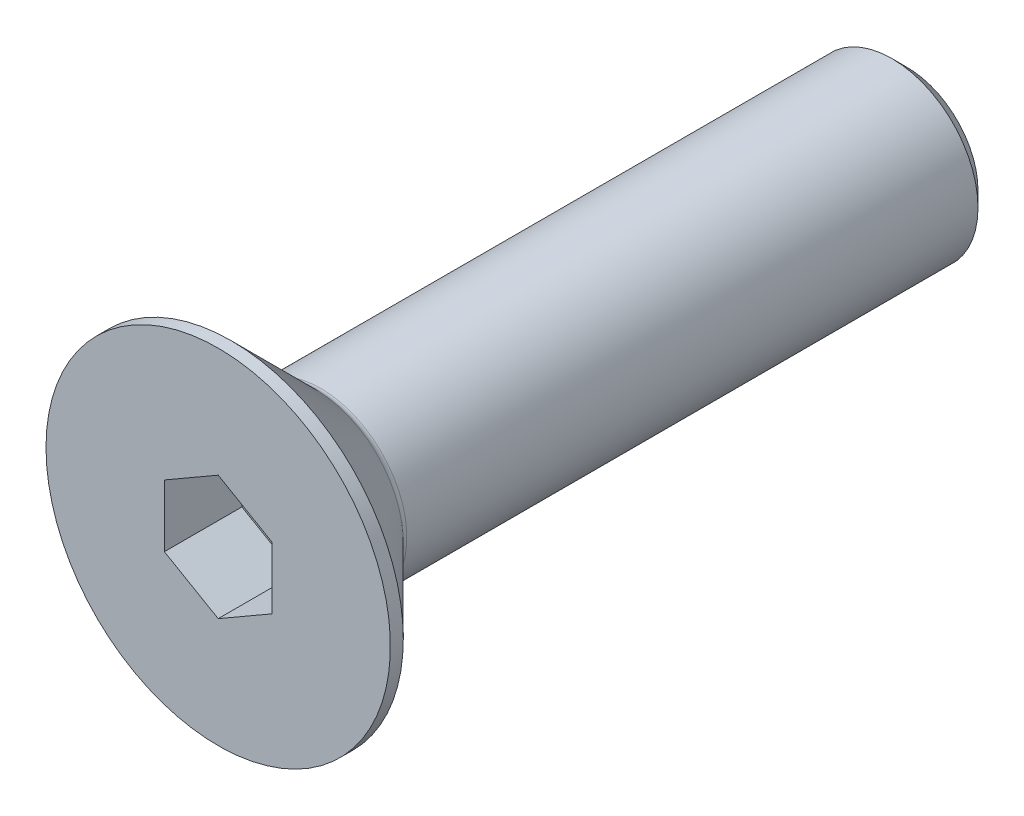
ISO-10303-21;
HEADER;
FILE_DESCRIPTION(('STEP AP214'),'2;1');
FILE_NAME('part.step','',(''),(''),'','','');
FILE_SCHEMA(('AUTOMOTIVE_DESIGN { 1 0 10303 214 1 1 1 1 }'));
ENDSEC;
DATA;
#1=APPLICATION_CONTEXT('core data for automotive mechanical design processes');
#2=APPLICATION_PROTOCOL_DEFINITION('international standard','automotive_design',2000,#1);
#3=PRODUCT_CONTEXT('',#1,'mechanical');
#4=PRODUCT('Part','Part','',(#3));
#5=PRODUCT_RELATED_PRODUCT_CATEGORY('part','',(#4));
#6=PRODUCT_DEFINITION_FORMATION('','',#4);
#7=PRODUCT_DEFINITION_CONTEXT('part definition',#1,'design');
#8=PRODUCT_DEFINITION('design','',#6,#7);
#9=PRODUCT_DEFINITION_SHAPE('','',#8);
#10=(LENGTH_UNIT() NAMED_UNIT(*) SI_UNIT(.MILLI.,.METRE.));
#11=(NAMED_UNIT(*) PLANE_ANGLE_UNIT() SI_UNIT($,.RADIAN.));
#12=(NAMED_UNIT(*) SI_UNIT($,.STERADIAN.) SOLID_ANGLE_UNIT());
#13=UNCERTAINTY_MEASURE_WITH_UNIT(LENGTH_MEASURE(1.E-05),#10,'distance_accuracy_value','');
#14=(GEOMETRIC_REPRESENTATION_CONTEXT(3) GLOBAL_UNCERTAINTY_ASSIGNED_CONTEXT((#13)) GLOBAL_UNIT_ASSIGNED_CONTEXT((#10,
#11,#12)) REPRESENTATION_CONTEXT('',''));
#15=CARTESIAN_POINT('',(0.,0.,0.));
#16=DIRECTION('',(0.,0.,1.));
#17=DIRECTION('',(1.,0.,0.));
#18=AXIS2_PLACEMENT_3D('',#15,#16,#17);
#19=CARTESIAN_POINT('',(0.,1.44337567297406,0.));
#20=DIRECTION('',(-0.5,0.866025403784439,0.));
#21=DIRECTION('',(-0.866025403784439,-0.5,0.));
#22=AXIS2_PLACEMENT_3D('',#19,#20,#21);
#23=PLANE('',#22);
#24=DIRECTION('',(0.,0.,1.));
#25=VECTOR('',#24,1.);
#26=CARTESIAN_POINT('',(0.,1.44337567297406,0.));
#27=LINE('',#26,#25);
#28=CARTESIAN_POINT('',(0.,1.44337567297406,-1.8));
#29=VERTEX_POINT('',#28);
#30=CARTESIAN_POINT('',(0.,1.44337567297406,0.));
#31=VERTEX_POINT('',#30);
#32=EDGE_CURVE('E81',#29,#31,#27,.T.);
#33=ORIENTED_EDGE('',*,*,#32,.T.);
#34=DIRECTION('',(-0.866025403784439,-0.5,0.));
#35=VECTOR('',#34,1.);
#36=CARTESIAN_POINT('',(0.,1.44337567297406,0.));
#37=LINE('',#36,#35);
#38=CARTESIAN_POINT('',(-1.25,0.721687836487033,0.));
#39=VERTEX_POINT('',#38);
#40=EDGE_CURVE('E70',#39,#31,#37,.F.);
#41=ORIENTED_EDGE('',*,*,#40,.F.);
#42=DIRECTION('',(0.,0.,1.));
#43=VECTOR('',#42,1.);
#44=CARTESIAN_POINT('',(-1.25,0.721687836487033,0.));
#45=LINE('',#44,#43);
#46=CARTESIAN_POINT('',(-1.25,0.721687836487033,-1.8));
#47=VERTEX_POINT('',#46);
#48=EDGE_CURVE('E137',#39,#47,#45,.F.);
#49=ORIENTED_EDGE('',*,*,#48,.T.);
#50=DIRECTION('',(-0.866025403784439,-0.5,0.));
#51=VECTOR('',#50,1.);
#52=CARTESIAN_POINT('',(0.,1.44337567297406,-1.8));
#53=LINE('',#52,#51);
#54=EDGE_CURVE('E66',#29,#47,#53,.T.);
#55=ORIENTED_EDGE('',*,*,#54,.F.);
#56=EDGE_LOOP('',(#33,#41,#49,#55));
#57=FACE_BOUND('',#56,.T.);
#58=ADVANCED_FACE('F15',(#57),#23,.F.);
#59=CARTESIAN_POINT('',(1.25,0.721687836487033,0.));
#60=DIRECTION('',(0.499999999999999,0.866025403784439,0.));
#61=DIRECTION('',(-0.866025403784439,0.499999999999999,0.));
#62=AXIS2_PLACEMENT_3D('',#59,#60,#61);
#63=PLANE('',#62);
#64=DIRECTION('',(0.,0.,-1.));
#65=VECTOR('',#64,1.);
#66=CARTESIAN_POINT('',(1.25,0.721687836487033,0.));
#67=LINE('',#66,#65);
#68=CARTESIAN_POINT('',(1.25,0.721687836487033,-1.8));
#69=VERTEX_POINT('',#68);
#70=CARTESIAN_POINT('',(1.25,0.721687836487033,0.));
#71=VERTEX_POINT('',#70);
#72=EDGE_CURVE('E86',#69,#71,#67,.F.);
#73=ORIENTED_EDGE('',*,*,#72,.T.);
#74=DIRECTION('',(-0.866025403784439,0.499999999999999,0.));
#75=VECTOR('',#74,1.);
#76=CARTESIAN_POINT('',(1.25,0.721687836487033,0.));
#77=LINE('',#76,#75);
#78=EDGE_CURVE('E74',#31,#71,#77,.F.);
#79=ORIENTED_EDGE('',*,*,#78,.F.);
#80=ORIENTED_EDGE('',*,*,#32,.F.);
#81=DIRECTION('',(-0.866025403784439,0.499999999999999,0.));
#82=VECTOR('',#81,1.);
#83=CARTESIAN_POINT('',(1.25,0.721687836487033,-1.8));
#84=LINE('',#83,#82);
#85=EDGE_CURVE('E87',#69,#29,#84,.T.);
#86=ORIENTED_EDGE('',*,*,#85,.F.);
#87=EDGE_LOOP('',(#73,#79,#80,#86));
#88=FACE_BOUND('',#87,.T.);
#89=ADVANCED_FACE('F84',(#88),#63,.F.);
#90=CARTESIAN_POINT('',(-1.25,0.721687836487033,0.));
#91=DIRECTION('',(-1.,0.,0.));
#92=DIRECTION('',(0.,0.,1.));
#93=AXIS2_PLACEMENT_3D('',#90,#91,#92);
#94=PLANE('',#93);
#95=ORIENTED_EDGE('',*,*,#48,.F.);
#96=DIRECTION('',(0.,1.,0.));
#97=VECTOR('',#96,1.);
#98=CARTESIAN_POINT('',(-1.25,0.721687836487033,0.));
#99=LINE('',#98,#97);
#100=CARTESIAN_POINT('',(-1.25,-0.721687836487033,0.));
#101=VERTEX_POINT('',#100);
#102=EDGE_CURVE('E77',#101,#39,#99,.T.);
#103=ORIENTED_EDGE('',*,*,#102,.F.);
#104=DIRECTION('',(0.,0.,1.));
#105=VECTOR('',#104,1.);
#106=CARTESIAN_POINT('',(-1.25,-0.721687836487033,0.));
#107=LINE('',#106,#105);
#108=CARTESIAN_POINT('',(-1.25,-0.721687836487033,-1.8));
#109=VERTEX_POINT('',#108);
#110=EDGE_CURVE('E128',#101,#109,#107,.F.);
#111=ORIENTED_EDGE('',*,*,#110,.T.);
#112=DIRECTION('',(0.,1.,0.));
#113=VECTOR('',#112,1.);
#114=CARTESIAN_POINT('',(-1.25,0.721687836487033,-1.8));
#115=LINE('',#114,#113);
#116=EDGE_CURVE('E135',#47,#109,#115,.F.);
#117=ORIENTED_EDGE('',*,*,#116,.F.);
#118=EDGE_LOOP('',(#95,#103,#111,#117));
#119=FACE_BOUND('',#118,.T.);
#120=ADVANCED_FACE('F140',(#119),#94,.F.);
#121=CARTESIAN_POINT('',(1.25,-0.721687836487033,0.));
#122=DIRECTION('',(1.,0.,0.));
#123=DIRECTION('',(0.,0.,-1.));
#124=AXIS2_PLACEMENT_3D('',#121,#122,#123);
#125=PLANE('',#124);
#126=DIRECTION('',(0.,0.,1.));
#127=VECTOR('',#126,1.);
#128=CARTESIAN_POINT('',(1.25,-0.721687836487032,0.));
#129=LINE('',#128,#127);
#130=CARTESIAN_POINT('',(1.25,-0.721687836487033,-1.8));
#131=VERTEX_POINT('',#130);
#132=CARTESIAN_POINT('',(1.25,-0.721687836487033,0.));
#133=VERTEX_POINT('',#132);
#134=EDGE_CURVE('E120',#131,#133,#129,.T.);
#135=ORIENTED_EDGE('',*,*,#134,.T.);
#136=DIRECTION('',(0.,1.,0.));
#137=VECTOR('',#136,1.);
#138=CARTESIAN_POINT('',(1.25,-0.721687836487033,0.));
#139=LINE('',#138,#137);
#140=EDGE_CURVE('E34',#71,#133,#139,.F.);
#141=ORIENTED_EDGE('',*,*,#140,.F.);
#142=ORIENTED_EDGE('',*,*,#72,.F.);
#143=DIRECTION('',(0.,1.,0.));
#144=VECTOR('',#143,1.);
#145=CARTESIAN_POINT('',(1.25,0.,-1.8));
#146=LINE('',#145,#144);
#147=EDGE_CURVE('E122',#131,#69,#146,.T.);
#148=ORIENTED_EDGE('',*,*,#147,.F.);
#149=EDGE_LOOP('',(#135,#141,#142,#148));
#150=FACE_BOUND('',#149,.T.);
#151=ADVANCED_FACE('F147',(#150),#125,.F.);
#152=CARTESIAN_POINT('',(-1.25,-0.721687836487033,0.));
#153=DIRECTION('',(-0.499999999999999,-0.866025403784439,0.));
#154=DIRECTION('',(0.866025403784439,-0.499999999999999,0.));
#155=AXIS2_PLACEMENT_3D('',#152,#153,#154);
#156=PLANE('',#155);
#157=ORIENTED_EDGE('',*,*,#110,.F.);
#158=DIRECTION('',(0.866025403784439,-0.499999999999999,0.));
#159=VECTOR('',#158,1.);
#160=CARTESIAN_POINT('',(-1.25,-0.721687836487033,0.));
#161=LINE('',#160,#159);
#162=CARTESIAN_POINT('',(0.,-1.44337567297406,0.));
#163=VERTEX_POINT('',#162);
#164=EDGE_CURVE('E131',#163,#101,#161,.F.);
#165=ORIENTED_EDGE('',*,*,#164,.F.);
#166=DIRECTION('',(0.,0.,1.));
#167=VECTOR('',#166,1.);
#168=CARTESIAN_POINT('',(0.,-1.44337567297406,0.));
#169=LINE('',#168,#167);
#170=CARTESIAN_POINT('',(0.,-1.44337567297406,-1.8));
#171=VERTEX_POINT('',#170);
#172=EDGE_CURVE('E118',#163,#171,#169,.F.);
#173=ORIENTED_EDGE('',*,*,#172,.T.);
#174=DIRECTION('',(0.866025403784439,-0.499999999999999,0.));
#175=VECTOR('',#174,1.);
#176=CARTESIAN_POINT('',(-1.25,-0.721687836487033,-1.8));
#177=LINE('',#176,#175);
#178=EDGE_CURVE('E125',#109,#171,#177,.T.);
#179=ORIENTED_EDGE('',*,*,#178,.F.);
#180=EDGE_LOOP('',(#157,#165,#173,#179));
#181=FACE_BOUND('',#180,.T.);
#182=ADVANCED_FACE('F154',(#181),#156,.F.);
#183=CARTESIAN_POINT('',(0.,0.,-1.8));
#184=DIRECTION('',(0.,0.,1.));
#185=DIRECTION('',(1.,0.,0.));
#186=AXIS2_PLACEMENT_3D('',#183,#184,#185);
#187=PLANE('',#186);
#188=ORIENTED_EDGE('',*,*,#54,.T.);
#189=ORIENTED_EDGE('',*,*,#116,.T.);
#190=ORIENTED_EDGE('',*,*,#178,.T.);
#191=DIRECTION('',(0.866025403784439,0.5,0.));
#192=VECTOR('',#191,1.);
#193=CARTESIAN_POINT('',(0.,-1.44337567297406,-1.8));
#194=LINE('',#193,#192);
#195=EDGE_CURVE('E115',#171,#131,#194,.T.);
#196=ORIENTED_EDGE('',*,*,#195,.T.);
#197=ORIENTED_EDGE('',*,*,#147,.T.);
#198=ORIENTED_EDGE('',*,*,#85,.T.);
#199=EDGE_LOOP('',(#188,#189,#190,#196,#197,#198));
#200=FACE_BOUND('',#199,.T.);
#201=ADVANCED_FACE('F144',(#200),#187,.T.);
#202=CARTESIAN_POINT('',(0.,-1.44337567297406,0.));
#203=DIRECTION('',(0.5,-0.866025403784439,0.));
#204=DIRECTION('',(0.866025403784439,0.5,0.));
#205=AXIS2_PLACEMENT_3D('',#202,#203,#204);
#206=PLANE('',#205);
#207=ORIENTED_EDGE('',*,*,#172,.F.);
#208=DIRECTION('',(-0.866025403784439,-0.499999999999999,0.));
#209=VECTOR('',#208,1.);
#210=CARTESIAN_POINT('',(1.25,-0.721687836487033,0.));
#211=LINE('',#210,#209);
#212=EDGE_CURVE('E113',#133,#163,#211,.T.);
#213=ORIENTED_EDGE('',*,*,#212,.F.);
#214=ORIENTED_EDGE('',*,*,#134,.F.);
#215=ORIENTED_EDGE('',*,*,#195,.F.);
#216=EDGE_LOOP('',(#207,#213,#214,#215));
#217=FACE_BOUND('',#216,.T.);
#218=ADVANCED_FACE('F152',(#217),#206,.F.);
#219=CARTESIAN_POINT('',(2.,0.,0.));
#220=DIRECTION('',(0.,0.,1.));
#221=DIRECTION('',(1.,0.,0.));
#222=AXIS2_PLACEMENT_3D('',#219,#220,#221);
#223=PLANE('',#222);
#224=ORIENTED_EDGE('',*,*,#140,.T.);
#225=ORIENTED_EDGE('',*,*,#212,.T.);
#226=ORIENTED_EDGE('',*,*,#164,.T.);
#227=ORIENTED_EDGE('',*,*,#102,.T.);
#228=ORIENTED_EDGE('',*,*,#40,.T.);
#229=ORIENTED_EDGE('',*,*,#78,.T.);
#230=EDGE_LOOP('',(#224,#225,#226,#227,#228,#229));
#231=FACE_BOUND('',#230,.T.);
#232=CARTESIAN_POINT('',(0.,0.,0.));
#233=DIRECTION('',(0.,0.,-1.));
#234=DIRECTION('',(-1.,0.,0.));
#235=AXIS2_PLACEMENT_3D('',#232,#233,#234);
#236=CIRCLE('',#235,4.);
#237=CARTESIAN_POINT('',(-4.,0.,0.));
#238=VERTEX_POINT('',#237);
#239=EDGE_CURVE('E19',#238,#238,#236,.T.);
#240=ORIENTED_EDGE('',*,*,#239,.F.);
#241=EDGE_LOOP('',(#240));
#242=FACE_BOUND('',#241,.T.);
#243=ADVANCED_FACE('F71',(#231,#242),#223,.T.);
#244=CARTESIAN_POINT('',(0.,0.,-0.150000000000001));
#245=DIRECTION('',(0.,0.,-1.));
#246=DIRECTION('',(-1.,0.,0.));
#247=AXIS2_PLACEMENT_3D('',#244,#245,#246);
#248=CYLINDRICAL_SURFACE('',#247,4.);
#249=ORIENTED_EDGE('',*,*,#239,.T.);
#250=EDGE_LOOP('',(#249));
#251=FACE_BOUND('',#250,.T.);
#252=CARTESIAN_POINT('',(0.,0.,-0.299999999128886));
#253=DIRECTION('',(0.,0.,1.));
#254=DIRECTION('',(1.,0.,0.));
#255=AXIS2_PLACEMENT_3D('',#252,#253,#254);
#256=CIRCLE('',#255,3.99999999905276);
#257=CARTESIAN_POINT('',(3.99999999905276,0.,-0.299999999128886));
#258=VERTEX_POINT('',#257);
#259=EDGE_CURVE('E100',#258,#258,#256,.F.);
#260=ORIENTED_EDGE('',*,*,#259,.F.);
#261=EDGE_LOOP('',(#260));
#262=FACE_BOUND('',#261,.T.);
#263=ADVANCED_FACE('F183',(#251,#262),#248,.T.);
#264=CARTESIAN_POINT('',(0.,0.,-0.299999999128886));
#265=DIRECTION('',(0.,0.,1.));
#266=DIRECTION('',(1.,0.,0.));
#267=AXIS2_PLACEMENT_3D('',#264,#265,#266);
#268=CONICAL_SURFACE('',#267,3.99999999905276,0.78539816250443);
#269=CARTESIAN_POINT('',(0.,0.,-2.24142135623731));
#270=DIRECTION('',(0.,0.,-1.));
#271=DIRECTION('',(-1.,0.,0.));
#272=AXIS2_PLACEMENT_3D('',#269,#270,#271);
#273=CIRCLE('',#272,2.05857864376269);
#274=CARTESIAN_POINT('',(-2.05857864376269,0.,-2.24142135623731));
#275=VERTEX_POINT('',#274);
#276=EDGE_CURVE('E94',#275,#275,#273,.T.);
#277=ORIENTED_EDGE('',*,*,#276,.F.);
#278=EDGE_LOOP('',(#277));
#279=FACE_BOUND('',#278,.T.);
#280=ORIENTED_EDGE('',*,*,#259,.T.);
#281=EDGE_LOOP('',(#280));
#282=FACE_BOUND('',#281,.T.);
#283=ADVANCED_FACE('F179',(#279,#282),#268,.T.);
#284=CARTESIAN_POINT('',(1.,0.,-16.));
#285=DIRECTION('',(0.,0.,-1.));
#286=DIRECTION('',(-1.,0.,0.));
#287=AXIS2_PLACEMENT_3D('',#284,#285,#286);
#288=PLANE('',#287);
#289=CARTESIAN_POINT('',(0.,0.,-16.0000000001332));
#290=DIRECTION('',(0.,0.,1.));
#291=DIRECTION('',(1.,0.,0.));
#292=AXIS2_PLACEMENT_3D('',#289,#290,#291);
#293=CIRCLE('',#292,1.65000000015425);
#294=CARTESIAN_POINT('',(1.65000000015425,0.,-16.0000000001332));
#295=VERTEX_POINT('',#294);
#296=EDGE_CURVE('E92',#295,#295,#293,.T.);
#297=ORIENTED_EDGE('',*,*,#296,.F.);
#298=EDGE_LOOP('',(#297));
#299=FACE_BOUND('',#298,.T.);
#300=ADVANCED_FACE('F176',(#299),#288,.T.);
#301=CARTESIAN_POINT('',(0.,0.,-2.38284271247462));
#302=DIRECTION('',(0.,0.,-1.));
#303=DIRECTION('',(-1.,0.,0.));
#304=AXIS2_PLACEMENT_3D('',#301,#302,#303);
#305=TOROIDAL_SURFACE('',#304,2.2,0.2);
#306=CARTESIAN_POINT('',(0.,0.,-2.38284271247462));
#307=DIRECTION('',(0.,0.,-1.));
#308=DIRECTION('',(-1.,0.,0.));
#309=AXIS2_PLACEMENT_3D('',#306,#307,#308);
#310=CIRCLE('',#309,2.);
#311=CARTESIAN_POINT('',(-2.,0.,-2.38284271247462));
#312=VERTEX_POINT('',#311);
#313=EDGE_CURVE('E25',#312,#312,#310,.T.);
#314=ORIENTED_EDGE('',*,*,#313,.F.);
#315=EDGE_LOOP('',(#314));
#316=FACE_BOUND('',#315,.T.);
#317=ORIENTED_EDGE('',*,*,#276,.T.);
#318=EDGE_LOOP('',(#317));
#319=FACE_BOUND('',#318,.T.);
#320=ADVANCED_FACE('F17',(#316,#319),#305,.F.);
#321=CARTESIAN_POINT('',(0.,0.,-15.64999999988));
#322=DIRECTION('',(0.,0.,1.));
#323=DIRECTION('',(1.,0.,0.));
#324=AXIS2_PLACEMENT_3D('',#321,#322,#323);
#325=CONICAL_SURFACE('',#324,1.99999999978218,0.785398162504195);
#326=ORIENTED_EDGE('',*,*,#296,.T.);
#327=EDGE_LOOP('',(#326));
#328=FACE_BOUND('',#327,.T.);
#329=CARTESIAN_POINT('',(0.,0.,-15.65));
#330=DIRECTION('',(0.,0.,-1.));
#331=DIRECTION('',(-1.,0.,0.));
#332=AXIS2_PLACEMENT_3D('',#329,#330,#331);
#333=CIRCLE('',#332,2.);
#334=CARTESIAN_POINT('',(-2.,0.,-15.65));
#335=VERTEX_POINT('',#334);
#336=EDGE_CURVE('E10',#335,#335,#333,.F.);
#337=ORIENTED_EDGE('',*,*,#336,.F.);
#338=EDGE_LOOP('',(#337));
#339=FACE_BOUND('',#338,.T.);
#340=ADVANCED_FACE('F166',(#328,#339),#325,.T.);
#341=CARTESIAN_POINT('',(0.,0.,-9.15));
#342=DIRECTION('',(0.,0.,-1.));
#343=DIRECTION('',(-1.,0.,0.));
#344=AXIS2_PLACEMENT_3D('',#341,#342,#343);
#345=CYLINDRICAL_SURFACE('',#344,2.);
#346=ORIENTED_EDGE('',*,*,#336,.T.);
#347=EDGE_LOOP('',(#346));
#348=FACE_BOUND('',#347,.T.);
#349=ORIENTED_EDGE('',*,*,#313,.T.);
#350=EDGE_LOOP('',(#349));
#351=FACE_BOUND('',#350,.T.);
#352=ADVANCED_FACE('F164',(#348,#351),#345,.T.);
#353=CLOSED_SHELL('',(#58,#89,#120,#151,#182,#201,#218,#243,#263,#283,#300,#320,#340,#352));
#354=MANIFOLD_SOLID_BREP('B1',#353);
#355=ADVANCED_BREP_SHAPE_REPRESENTATION('',(#18,#354),#14);
#356=SHAPE_DEFINITION_REPRESENTATION(#9,#355);
ENDSEC;
END-ISO-10303-21;
